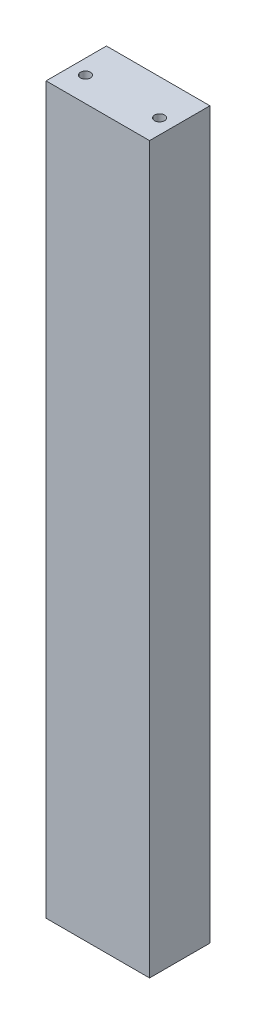
ISO-10303-21;
HEADER;
FILE_DESCRIPTION(('STEP AP214'),'2;1');
FILE_NAME('part.step','',(''),(''),'','','');
FILE_SCHEMA(('AUTOMOTIVE_DESIGN { 1 0 10303 214 1 1 1 1 }'));
ENDSEC;
DATA;
#1=APPLICATION_CONTEXT('core data for automotive mechanical design processes');
#2=APPLICATION_PROTOCOL_DEFINITION('international standard','automotive_design',2000,#1);
#3=PRODUCT_CONTEXT('',#1,'mechanical');
#4=PRODUCT('Part','Part','',(#3));
#5=PRODUCT_RELATED_PRODUCT_CATEGORY('part','',(#4));
#6=PRODUCT_DEFINITION_FORMATION('','',#4);
#7=PRODUCT_DEFINITION_CONTEXT('part definition',#1,'design');
#8=PRODUCT_DEFINITION('design','',#6,#7);
#9=PRODUCT_DEFINITION_SHAPE('','',#8);
#10=(LENGTH_UNIT() NAMED_UNIT(*) SI_UNIT(.MILLI.,.METRE.));
#11=(NAMED_UNIT(*) PLANE_ANGLE_UNIT() SI_UNIT($,.RADIAN.));
#12=(NAMED_UNIT(*) SI_UNIT($,.STERADIAN.) SOLID_ANGLE_UNIT());
#13=UNCERTAINTY_MEASURE_WITH_UNIT(LENGTH_MEASURE(1.E-05),#10,'distance_accuracy_value','');
#14=(GEOMETRIC_REPRESENTATION_CONTEXT(3) GLOBAL_UNCERTAINTY_ASSIGNED_CONTEXT((#13)) GLOBAL_UNIT_ASSIGNED_CONTEXT((#10,
#11,#12)) REPRESENTATION_CONTEXT('',''));
#15=CARTESIAN_POINT('',(0.,0.,0.));
#16=DIRECTION('',(0.,0.,1.));
#17=DIRECTION('',(1.,0.,0.));
#18=AXIS2_PLACEMENT_3D('',#15,#16,#17);
#19=CARTESIAN_POINT('',(0.,293.6875,0.));
#20=DIRECTION('',(1.,0.,0.));
#21=DIRECTION('',(0.,0.,-1.));
#22=AXIS2_PLACEMENT_3D('',#19,#20,#21);
#23=PLANE('',#22);
#24=DIRECTION('',(0.,0.,1.));
#25=VECTOR('',#24,1.);
#26=CARTESIAN_POINT('',(0.,0.,0.));
#27=LINE('',#26,#25);
#28=CARTESIAN_POINT('',(0.,0.,-24.4475));
#29=VERTEX_POINT('',#28);
#30=CARTESIAN_POINT('',(0.,0.,0.));
#31=VERTEX_POINT('',#30);
#32=EDGE_CURVE('E130',#29,#31,#27,.T.);
#33=ORIENTED_EDGE('',*,*,#32,.T.);
#34=DIRECTION('',(0.,-1.,0.));
#35=VECTOR('',#34,1.);
#36=CARTESIAN_POINT('',(0.,293.6875,0.));
#37=LINE('',#36,#35);
#38=CARTESIAN_POINT('',(0.,293.6875,0.));
#39=VERTEX_POINT('',#38);
#40=EDGE_CURVE('E11',#39,#31,#37,.T.);
#41=ORIENTED_EDGE('',*,*,#40,.F.);
#42=DIRECTION('',(0.,0.,1.));
#43=VECTOR('',#42,1.);
#44=CARTESIAN_POINT('',(0.,293.6875,0.));
#45=LINE('',#44,#43);
#46=CARTESIAN_POINT('',(0.,293.6875,-24.4475));
#47=VERTEX_POINT('',#46);
#48=EDGE_CURVE('E131',#47,#39,#45,.T.);
#49=ORIENTED_EDGE('',*,*,#48,.F.);
#50=DIRECTION('',(0.,-1.,0.));
#51=VECTOR('',#50,1.);
#52=CARTESIAN_POINT('',(0.,293.6875,-24.4475));
#53=LINE('',#52,#51);
#54=EDGE_CURVE('E137',#47,#29,#53,.T.);
#55=ORIENTED_EDGE('',*,*,#54,.T.);
#56=EDGE_LOOP('',(#33,#41,#49,#55));
#57=FACE_BOUND('',#56,.T.);
#58=ADVANCED_FACE('F37',(#57),#23,.F.);
#59=CARTESIAN_POINT('',(0.,293.6875,0.));
#60=DIRECTION('',(0.,0.,-1.));
#61=DIRECTION('',(-1.,0.,0.));
#62=AXIS2_PLACEMENT_3D('',#59,#60,#61);
#63=PLANE('',#62);
#64=DIRECTION('',(1.,0.,0.));
#65=VECTOR('',#64,1.);
#66=CARTESIAN_POINT('',(0.,0.,0.));
#67=LINE('',#66,#65);
#68=CARTESIAN_POINT('',(41.91,0.,0.));
#69=VERTEX_POINT('',#68);
#70=EDGE_CURVE('E140',#31,#69,#67,.T.);
#71=ORIENTED_EDGE('',*,*,#70,.T.);
#72=DIRECTION('',(0.,-1.,0.));
#73=VECTOR('',#72,1.);
#74=CARTESIAN_POINT('',(41.91,293.6875,0.));
#75=LINE('',#74,#73);
#76=CARTESIAN_POINT('',(41.91,293.6875,0.));
#77=VERTEX_POINT('',#76);
#78=EDGE_CURVE('E45',#77,#69,#75,.T.);
#79=ORIENTED_EDGE('',*,*,#78,.F.);
#80=DIRECTION('',(1.,0.,0.));
#81=VECTOR('',#80,1.);
#82=CARTESIAN_POINT('',(0.,293.6875,0.));
#83=LINE('',#82,#81);
#84=EDGE_CURVE('E84',#39,#77,#83,.T.);
#85=ORIENTED_EDGE('',*,*,#84,.F.);
#86=ORIENTED_EDGE('',*,*,#40,.T.);
#87=EDGE_LOOP('',(#71,#79,#85,#86));
#88=FACE_BOUND('',#87,.T.);
#89=ADVANCED_FACE('F164',(#88),#63,.F.);
#90=CARTESIAN_POINT('',(41.91,293.6875,0.));
#91=DIRECTION('',(-1.,0.,0.));
#92=DIRECTION('',(0.,0.,1.));
#93=AXIS2_PLACEMENT_3D('',#90,#91,#92);
#94=PLANE('',#93);
#95=DIRECTION('',(0.,0.,-1.));
#96=VECTOR('',#95,1.);
#97=CARTESIAN_POINT('',(41.91,0.,0.));
#98=LINE('',#97,#96);
#99=CARTESIAN_POINT('',(41.91,0.,-24.4475));
#100=VERTEX_POINT('',#99);
#101=EDGE_CURVE('E71',#69,#100,#98,.T.);
#102=ORIENTED_EDGE('',*,*,#101,.T.);
#103=DIRECTION('',(0.,-1.,0.));
#104=VECTOR('',#103,1.);
#105=CARTESIAN_POINT('',(41.91,293.6875,-24.4475));
#106=LINE('',#105,#104);
#107=CARTESIAN_POINT('',(41.91,293.6875,-24.4475));
#108=VERTEX_POINT('',#107);
#109=EDGE_CURVE('E145',#108,#100,#106,.T.);
#110=ORIENTED_EDGE('',*,*,#109,.F.);
#111=DIRECTION('',(0.,0.,-1.));
#112=VECTOR('',#111,1.);
#113=CARTESIAN_POINT('',(41.91,293.6875,0.));
#114=LINE('',#113,#112);
#115=EDGE_CURVE('E134',#77,#108,#114,.T.);
#116=ORIENTED_EDGE('',*,*,#115,.F.);
#117=ORIENTED_EDGE('',*,*,#78,.T.);
#118=EDGE_LOOP('',(#102,#110,#116,#117));
#119=FACE_BOUND('',#118,.T.);
#120=ADVANCED_FACE('F147',(#119),#94,.F.);
#121=CARTESIAN_POINT('',(0.,293.6875,-24.4475));
#122=DIRECTION('',(0.,0.,1.));
#123=DIRECTION('',(1.,0.,0.));
#124=AXIS2_PLACEMENT_3D('',#121,#122,#123);
#125=PLANE('',#124);
#126=DIRECTION('',(-1.,0.,0.));
#127=VECTOR('',#126,1.);
#128=CARTESIAN_POINT('',(0.,0.,-24.4475));
#129=LINE('',#128,#127);
#130=EDGE_CURVE('E77',#100,#29,#129,.T.);
#131=ORIENTED_EDGE('',*,*,#130,.T.);
#132=ORIENTED_EDGE('',*,*,#54,.F.);
#133=DIRECTION('',(-1.,0.,0.));
#134=VECTOR('',#133,1.);
#135=CARTESIAN_POINT('',(0.,293.6875,-24.4475));
#136=LINE('',#135,#134);
#137=EDGE_CURVE('E53',#108,#47,#136,.T.);
#138=ORIENTED_EDGE('',*,*,#137,.F.);
#139=ORIENTED_EDGE('',*,*,#109,.T.);
#140=EDGE_LOOP('',(#131,#132,#138,#139));
#141=FACE_BOUND('',#140,.T.);
#142=ADVANCED_FACE('F154',(#141),#125,.F.);
#143=CARTESIAN_POINT('',(0.,293.6875,0.));
#144=DIRECTION('',(0.,-1.,0.));
#145=DIRECTION('',(0.,0.,-1.));
#146=AXIS2_PLACEMENT_3D('',#143,#144,#145);
#147=PLANE('',#146);
#148=CARTESIAN_POINT('',(5.955,293.6875,-10.));
#149=DIRECTION('',(0.,1.,0.));
#150=DIRECTION('',(0.,0.,1.));
#151=AXIS2_PLACEMENT_3D('',#148,#149,#150);
#152=CIRCLE('',#151,2.01929999999999);
#153=CARTESIAN_POINT('',(5.955,293.6875,-7.98070000000002));
#154=VERTEX_POINT('',#153);
#155=EDGE_CURVE('E118',#154,#154,#152,.T.);
#156=ORIENTED_EDGE('',*,*,#155,.F.);
#157=EDGE_LOOP('',(#156));
#158=FACE_BOUND('',#157,.T.);
#159=CARTESIAN_POINT('',(35.955,293.6875,-10.));
#160=DIRECTION('',(0.,1.,0.));
#161=DIRECTION('',(0.,0.,1.));
#162=AXIS2_PLACEMENT_3D('',#159,#160,#161);
#163=CIRCLE('',#162,2.01929999999999);
#164=CARTESIAN_POINT('',(35.955,293.6875,-7.98070000000002));
#165=VERTEX_POINT('',#164);
#166=EDGE_CURVE('E124',#165,#165,#163,.T.);
#167=ORIENTED_EDGE('',*,*,#166,.F.);
#168=EDGE_LOOP('',(#167));
#169=FACE_BOUND('',#168,.T.);
#170=ORIENTED_EDGE('',*,*,#48,.T.);
#171=ORIENTED_EDGE('',*,*,#84,.T.);
#172=ORIENTED_EDGE('',*,*,#115,.T.);
#173=ORIENTED_EDGE('',*,*,#137,.T.);
#174=EDGE_LOOP('',(#170,#171,#172,#173));
#175=FACE_BOUND('',#174,.T.);
#176=ADVANCED_FACE('F156',(#158,#169,#175),#147,.F.);
#177=CARTESIAN_POINT('',(0.,0.,0.));
#178=DIRECTION('',(0.,-1.,0.));
#179=DIRECTION('',(0.,0.,-1.));
#180=AXIS2_PLACEMENT_3D('',#177,#178,#179);
#181=PLANE('',#180);
#182=CARTESIAN_POINT('',(35.955,0.,-10.000000066));
#183=DIRECTION('',(0.,-1.,0.));
#184=DIRECTION('',(0.,0.,-1.));
#185=AXIS2_PLACEMENT_3D('',#182,#183,#184);
#186=CIRCLE('',#185,2.01929999999999);
#187=CARTESIAN_POINT('',(35.955,0.,-12.019300066));
#188=VERTEX_POINT('',#187);
#189=EDGE_CURVE('E108',#188,#188,#186,.T.);
#190=ORIENTED_EDGE('',*,*,#189,.F.);
#191=EDGE_LOOP('',(#190));
#192=FACE_BOUND('',#191,.T.);
#193=CARTESIAN_POINT('',(5.955,0.,-10.000000066));
#194=DIRECTION('',(0.,-1.,0.));
#195=DIRECTION('',(0.,0.,-1.));
#196=AXIS2_PLACEMENT_3D('',#193,#194,#195);
#197=CIRCLE('',#196,2.01929999999999);
#198=CARTESIAN_POINT('',(5.955,0.,-12.019300066));
#199=VERTEX_POINT('',#198);
#200=EDGE_CURVE('E107',#199,#199,#197,.T.);
#201=ORIENTED_EDGE('',*,*,#200,.F.);
#202=EDGE_LOOP('',(#201));
#203=FACE_BOUND('',#202,.T.);
#204=ORIENTED_EDGE('',*,*,#32,.F.);
#205=ORIENTED_EDGE('',*,*,#130,.F.);
#206=ORIENTED_EDGE('',*,*,#101,.F.);
#207=ORIENTED_EDGE('',*,*,#70,.F.);
#208=EDGE_LOOP('',(#204,#205,#206,#207));
#209=FACE_BOUND('',#208,.T.);
#210=ADVANCED_FACE('F150',(#192,#203,#209),#181,.T.);
#211=CARTESIAN_POINT('',(35.955,274.8915,-10.));
#212=DIRECTION('',(0.,1.,0.));
#213=DIRECTION('',(0.,0.,1.));
#214=AXIS2_PLACEMENT_3D('',#211,#212,#213);
#215=CONICAL_SURFACE('',#214,2.01929999999999,1.02974425867664);
#216=CARTESIAN_POINT('',(35.955,273.678182151998,-10.));
#217=VERTEX_POINT('',#216);
#218=VERTEX_LOOP('',#217);
#219=FACE_BOUND('',#218,.T.);
#220=CARTESIAN_POINT('',(35.955,274.8915,-10.));
#221=DIRECTION('',(0.,1.,0.));
#222=DIRECTION('',(0.,0.,1.));
#223=AXIS2_PLACEMENT_3D('',#220,#221,#222);
#224=CIRCLE('',#223,2.01929999999999);
#225=CARTESIAN_POINT('',(35.955,274.8915,-7.98070000000001));
#226=VERTEX_POINT('',#225);
#227=EDGE_CURVE('E127',#226,#226,#224,.T.);
#228=ORIENTED_EDGE('',*,*,#227,.T.);
#229=EDGE_LOOP('',(#228));
#230=FACE_BOUND('',#229,.T.);
#231=ADVANCED_FACE('F194',(#219,#230),#215,.F.);
#232=CARTESIAN_POINT('',(35.955,293.6875,-10.));
#233=DIRECTION('',(0.,1.,0.));
#234=DIRECTION('',(0.,0.,1.));
#235=AXIS2_PLACEMENT_3D('',#232,#233,#234);
#236=CYLINDRICAL_SURFACE('',#235,2.01929999999999);
#237=ORIENTED_EDGE('',*,*,#227,.F.);
#238=EDGE_LOOP('',(#237));
#239=FACE_BOUND('',#238,.T.);
#240=ORIENTED_EDGE('',*,*,#166,.T.);
#241=EDGE_LOOP('',(#240));
#242=FACE_BOUND('',#241,.T.);
#243=ADVANCED_FACE('F199',(#239,#242),#236,.F.);
#244=CARTESIAN_POINT('',(5.955,274.8915,-10.));
#245=DIRECTION('',(0.,1.,0.));
#246=DIRECTION('',(0.,0.,1.));
#247=AXIS2_PLACEMENT_3D('',#244,#245,#246);
#248=CONICAL_SURFACE('',#247,2.0193,1.02974425867664);
#249=CARTESIAN_POINT('',(5.955,273.678182151998,-10.));
#250=VERTEX_POINT('',#249);
#251=VERTEX_LOOP('',#250);
#252=FACE_BOUND('',#251,.T.);
#253=CARTESIAN_POINT('',(5.955,274.8915,-10.));
#254=DIRECTION('',(0.,1.,0.));
#255=DIRECTION('',(0.,0.,1.));
#256=AXIS2_PLACEMENT_3D('',#253,#254,#255);
#257=CIRCLE('',#256,2.0193);
#258=CARTESIAN_POINT('',(5.955,274.8915,-7.98070000000001));
#259=VERTEX_POINT('',#258);
#260=EDGE_CURVE('E121',#259,#259,#257,.T.);
#261=ORIENTED_EDGE('',*,*,#260,.T.);
#262=EDGE_LOOP('',(#261));
#263=FACE_BOUND('',#262,.T.);
#264=ADVANCED_FACE('F210',(#252,#263),#248,.F.);
#265=CARTESIAN_POINT('',(5.955,293.6875,-10.));
#266=DIRECTION('',(0.,1.,0.));
#267=DIRECTION('',(0.,0.,1.));
#268=AXIS2_PLACEMENT_3D('',#265,#266,#267);
#269=CYLINDRICAL_SURFACE('',#268,2.01929999999999);
#270=ORIENTED_EDGE('',*,*,#260,.F.);
#271=EDGE_LOOP('',(#270));
#272=FACE_BOUND('',#271,.T.);
#273=ORIENTED_EDGE('',*,*,#155,.T.);
#274=EDGE_LOOP('',(#273));
#275=FACE_BOUND('',#274,.T.);
#276=ADVANCED_FACE('F222',(#272,#275),#269,.F.);
#277=CARTESIAN_POINT('',(5.955,18.796,-10.000000066));
#278=DIRECTION('',(0.,-1.,0.));
#279=DIRECTION('',(0.,0.,-1.));
#280=AXIS2_PLACEMENT_3D('',#277,#278,#279);
#281=CONICAL_SURFACE('',#280,2.0193,1.02974425867665);
#282=CARTESIAN_POINT('',(5.955,20.0093178480024,-10.000000066));
#283=VERTEX_POINT('',#282);
#284=VERTEX_LOOP('',#283);
#285=FACE_BOUND('',#284,.T.);
#286=CARTESIAN_POINT('',(5.955,18.796,-10.000000066));
#287=DIRECTION('',(0.,-1.,0.));
#288=DIRECTION('',(0.,0.,-1.));
#289=AXIS2_PLACEMENT_3D('',#286,#287,#288);
#290=CIRCLE('',#289,2.0193);
#291=CARTESIAN_POINT('',(5.955,18.796,-12.019300066));
#292=VERTEX_POINT('',#291);
#293=EDGE_CURVE('E111',#292,#292,#290,.T.);
#294=ORIENTED_EDGE('',*,*,#293,.T.);
#295=EDGE_LOOP('',(#294));
#296=FACE_BOUND('',#295,.T.);
#297=ADVANCED_FACE('F232',(#285,#296),#281,.F.);
#298=CARTESIAN_POINT('',(5.955,0.,-10.000000066));
#299=DIRECTION('',(0.,-1.,0.));
#300=DIRECTION('',(0.,0.,-1.));
#301=AXIS2_PLACEMENT_3D('',#298,#299,#300);
#302=CYLINDRICAL_SURFACE('',#301,2.01929999999999);
#303=ORIENTED_EDGE('',*,*,#293,.F.);
#304=EDGE_LOOP('',(#303));
#305=FACE_BOUND('',#304,.T.);
#306=ORIENTED_EDGE('',*,*,#200,.T.);
#307=EDGE_LOOP('',(#306));
#308=FACE_BOUND('',#307,.T.);
#309=ADVANCED_FACE('F101',(#305,#308),#302,.F.);
#310=CARTESIAN_POINT('',(35.955,18.796,-10.000000066));
#311=DIRECTION('',(0.,-1.,0.));
#312=DIRECTION('',(0.,0.,-1.));
#313=AXIS2_PLACEMENT_3D('',#310,#311,#312);
#314=CONICAL_SURFACE('',#313,2.01929999999999,1.02974425867665);
#315=CARTESIAN_POINT('',(35.955,20.0093178480024,-10.000000066));
#316=VERTEX_POINT('',#315);
#317=VERTEX_LOOP('',#316);
#318=FACE_BOUND('',#317,.T.);
#319=CARTESIAN_POINT('',(35.955,18.796,-10.000000066));
#320=DIRECTION('',(0.,-1.,0.));
#321=DIRECTION('',(0.,0.,-1.));
#322=AXIS2_PLACEMENT_3D('',#319,#320,#321);
#323=CIRCLE('',#322,2.01929999999999);
#324=CARTESIAN_POINT('',(35.955,18.796,-12.019300066));
#325=VERTEX_POINT('',#324);
#326=EDGE_CURVE('E105',#325,#325,#323,.T.);
#327=ORIENTED_EDGE('',*,*,#326,.T.);
#328=EDGE_LOOP('',(#327));
#329=FACE_BOUND('',#328,.T.);
#330=ADVANCED_FACE('F97',(#318,#329),#314,.F.);
#331=CARTESIAN_POINT('',(35.955,0.,-10.000000066));
#332=DIRECTION('',(0.,-1.,0.));
#333=DIRECTION('',(0.,0.,-1.));
#334=AXIS2_PLACEMENT_3D('',#331,#332,#333);
#335=CYLINDRICAL_SURFACE('',#334,2.01929999999999);
#336=ORIENTED_EDGE('',*,*,#326,.F.);
#337=EDGE_LOOP('',(#336));
#338=FACE_BOUND('',#337,.T.);
#339=ORIENTED_EDGE('',*,*,#189,.T.);
#340=EDGE_LOOP('',(#339));
#341=FACE_BOUND('',#340,.T.);
#342=ADVANCED_FACE('F100',(#338,#341),#335,.F.);
#343=CLOSED_SHELL('',(#58,#89,#120,#142,#176,#210,#231,#243,#264,#276,#297,#309,#330,#342));
#344=MANIFOLD_SOLID_BREP('B2',#343);
#345=ADVANCED_BREP_SHAPE_REPRESENTATION('',(#18,#344),#14);
#346=SHAPE_DEFINITION_REPRESENTATION(#9,#345);
ENDSEC;
END-ISO-10303-21;
